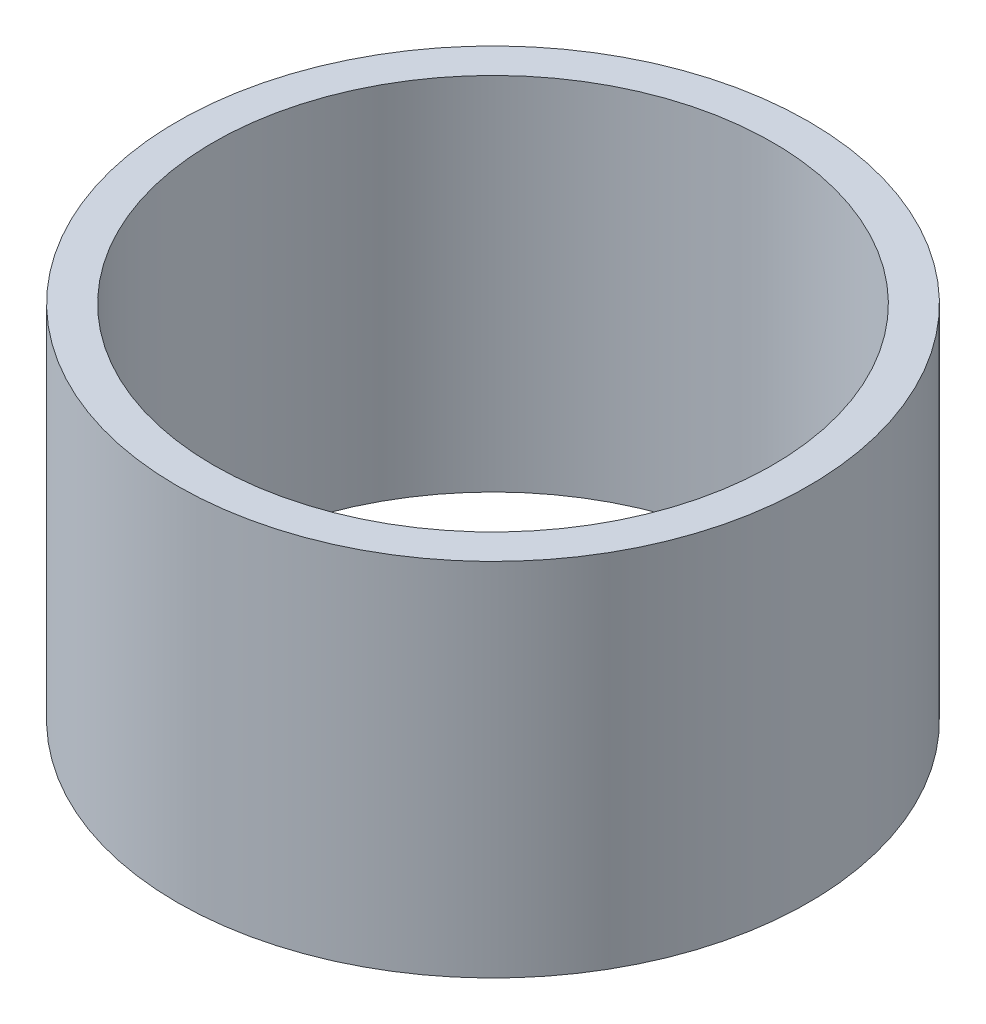
ISO-10303-21;
HEADER;
FILE_DESCRIPTION(('STEP AP214'),'2;1');
FILE_NAME('part.step','',(''),(''),'','','');
FILE_SCHEMA(('AUTOMOTIVE_DESIGN { 1 0 10303 214 1 1 1 1 }'));
ENDSEC;
DATA;
#1=APPLICATION_CONTEXT('core data for automotive mechanical design processes');
#2=APPLICATION_PROTOCOL_DEFINITION('international standard','automotive_design',2000,#1);
#3=PRODUCT_CONTEXT('',#1,'mechanical');
#4=PRODUCT('Part','Part','',(#3));
#5=PRODUCT_RELATED_PRODUCT_CATEGORY('part','',(#4));
#6=PRODUCT_DEFINITION_FORMATION('','',#4);
#7=PRODUCT_DEFINITION_CONTEXT('part definition',#1,'design');
#8=PRODUCT_DEFINITION('design','',#6,#7);
#9=PRODUCT_DEFINITION_SHAPE('','',#8);
#10=(LENGTH_UNIT() NAMED_UNIT(*) SI_UNIT(.MILLI.,.METRE.));
#11=(NAMED_UNIT(*) PLANE_ANGLE_UNIT() SI_UNIT($,.RADIAN.));
#12=(NAMED_UNIT(*) SI_UNIT($,.STERADIAN.) SOLID_ANGLE_UNIT());
#13=UNCERTAINTY_MEASURE_WITH_UNIT(LENGTH_MEASURE(1.E-05),#10,'distance_accuracy_value','');
#14=(GEOMETRIC_REPRESENTATION_CONTEXT(3) GLOBAL_UNCERTAINTY_ASSIGNED_CONTEXT((#13)) GLOBAL_UNIT_ASSIGNED_CONTEXT((#10,
#11,#12)) REPRESENTATION_CONTEXT('',''));
#15=CARTESIAN_POINT('',(0.,0.,0.));
#16=DIRECTION('',(0.,0.,1.));
#17=DIRECTION('',(1.,0.,0.));
#18=AXIS2_PLACEMENT_3D('',#15,#16,#17);
#19=CARTESIAN_POINT('',(0.,63.5,0.));
#20=DIRECTION('',(0.,-1.,0.));
#21=DIRECTION('',(0.,0.,-1.));
#22=AXIS2_PLACEMENT_3D('',#19,#20,#21);
#23=CYLINDRICAL_SURFACE('',#22,49.2125);
#24=CARTESIAN_POINT('',(0.,63.5,0.));
#25=DIRECTION('',(0.,1.,0.));
#26=DIRECTION('',(0.,0.,1.));
#27=AXIS2_PLACEMENT_3D('',#24,#25,#26);
#28=CIRCLE('',#27,49.2125);
#29=CARTESIAN_POINT('',(0.,63.5,49.2125));
#30=VERTEX_POINT('',#29);
#31=EDGE_CURVE('E47',#30,#30,#28,.T.);
#32=ORIENTED_EDGE('',*,*,#31,.T.);
#33=EDGE_LOOP('',(#32));
#34=FACE_BOUND('',#33,.T.);
#35=CARTESIAN_POINT('',(0.,0.,0.));
#36=DIRECTION('',(0.,1.,0.));
#37=DIRECTION('',(0.,0.,1.));
#38=AXIS2_PLACEMENT_3D('',#35,#36,#37);
#39=CIRCLE('',#38,49.2125);
#40=CARTESIAN_POINT('',(0.,0.,49.2125));
#41=VERTEX_POINT('',#40);
#42=EDGE_CURVE('E54',#41,#41,#39,.T.);
#43=ORIENTED_EDGE('',*,*,#42,.F.);
#44=EDGE_LOOP('',(#43));
#45=FACE_BOUND('',#44,.T.);
#46=ADVANCED_FACE('F39',(#34,#45),#23,.F.);
#47=CARTESIAN_POINT('',(0.,63.5,0.));
#48=DIRECTION('',(0.,-1.,0.));
#49=DIRECTION('',(0.,0.,-1.));
#50=AXIS2_PLACEMENT_3D('',#47,#48,#49);
#51=CYLINDRICAL_SURFACE('',#50,55.5625);
#52=CARTESIAN_POINT('',(0.,63.5,0.));
#53=DIRECTION('',(0.,1.,0.));
#54=DIRECTION('',(0.,0.,1.));
#55=AXIS2_PLACEMENT_3D('',#52,#53,#54);
#56=CIRCLE('',#55,55.5625);
#57=CARTESIAN_POINT('',(0.,63.5,55.5625));
#58=VERTEX_POINT('',#57);
#59=EDGE_CURVE('E10',#58,#58,#56,.T.);
#60=ORIENTED_EDGE('',*,*,#59,.F.);
#61=EDGE_LOOP('',(#60));
#62=FACE_BOUND('',#61,.T.);
#63=CARTESIAN_POINT('',(0.,0.,0.));
#64=DIRECTION('',(0.,1.,0.));
#65=DIRECTION('',(0.,0.,1.));
#66=AXIS2_PLACEMENT_3D('',#63,#64,#65);
#67=CIRCLE('',#66,55.5625);
#68=CARTESIAN_POINT('',(0.,0.,55.5625));
#69=VERTEX_POINT('',#68);
#70=EDGE_CURVE('E42',#69,#69,#67,.T.);
#71=ORIENTED_EDGE('',*,*,#70,.T.);
#72=EDGE_LOOP('',(#71));
#73=FACE_BOUND('',#72,.T.);
#74=ADVANCED_FACE('F63',(#62,#73),#51,.T.);
#75=CARTESIAN_POINT('',(0.,63.5,0.));
#76=DIRECTION('',(0.,1.,0.));
#77=DIRECTION('',(0.,0.,1.));
#78=AXIS2_PLACEMENT_3D('',#75,#76,#77);
#79=PLANE('',#78);
#80=ORIENTED_EDGE('',*,*,#31,.F.);
#81=EDGE_LOOP('',(#80));
#82=FACE_BOUND('',#81,.T.);
#83=ORIENTED_EDGE('',*,*,#59,.T.);
#84=EDGE_LOOP('',(#83));
#85=FACE_BOUND('',#84,.T.);
#86=ADVANCED_FACE('F67',(#82,#85),#79,.T.);
#87=CARTESIAN_POINT('',(0.,0.,0.));
#88=DIRECTION('',(0.,1.,0.));
#89=DIRECTION('',(0.,0.,1.));
#90=AXIS2_PLACEMENT_3D('',#87,#88,#89);
#91=PLANE('',#90);
#92=ORIENTED_EDGE('',*,*,#42,.T.);
#93=EDGE_LOOP('',(#92));
#94=FACE_BOUND('',#93,.T.);
#95=ORIENTED_EDGE('',*,*,#70,.F.);
#96=EDGE_LOOP('',(#95));
#97=FACE_BOUND('',#96,.T.);
#98=ADVANCED_FACE('F65',(#94,#97),#91,.F.);
#99=CLOSED_SHELL('',(#46,#74,#86,#98));
#100=MANIFOLD_SOLID_BREP('B2',#99);
#101=ADVANCED_BREP_SHAPE_REPRESENTATION('',(#18,#100),#14);
#102=SHAPE_DEFINITION_REPRESENTATION(#9,#101);
ENDSEC;
END-ISO-10303-21;
